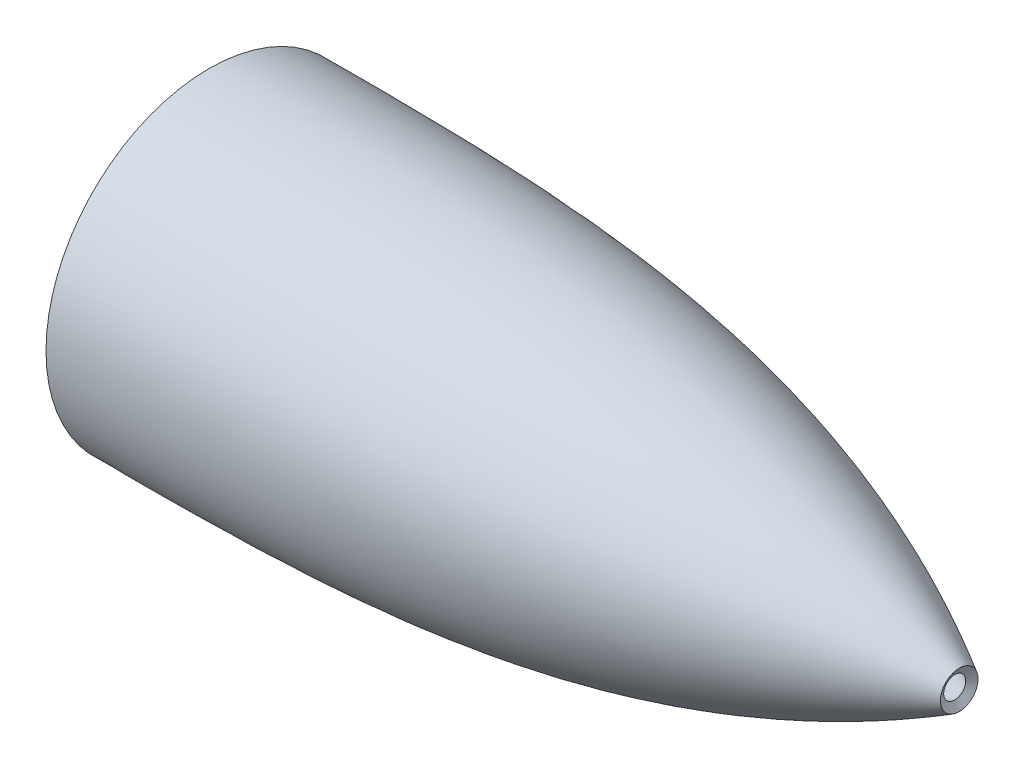
ISO-10303-21;
HEADER;
FILE_DESCRIPTION(('STEP AP214'),'2;1');
FILE_NAME('part.step','',(''),(''),'','','');
FILE_SCHEMA(('AUTOMOTIVE_DESIGN { 1 0 10303 214 1 1 1 1 }'));
ENDSEC;
DATA;
#1=APPLICATION_CONTEXT('core data for automotive mechanical design processes');
#2=APPLICATION_PROTOCOL_DEFINITION('international standard','automotive_design',2000,#1);
#3=PRODUCT_CONTEXT('',#1,'mechanical');
#4=PRODUCT('Part','Part','',(#3));
#5=PRODUCT_RELATED_PRODUCT_CATEGORY('part','',(#4));
#6=PRODUCT_DEFINITION_FORMATION('','',#4);
#7=PRODUCT_DEFINITION_CONTEXT('part definition',#1,'design');
#8=PRODUCT_DEFINITION('design','',#6,#7);
#9=PRODUCT_DEFINITION_SHAPE('','',#8);
#10=(LENGTH_UNIT() NAMED_UNIT(*) SI_UNIT(.MILLI.,.METRE.));
#11=(NAMED_UNIT(*) PLANE_ANGLE_UNIT() SI_UNIT($,.RADIAN.));
#12=(NAMED_UNIT(*) SI_UNIT($,.STERADIAN.) SOLID_ANGLE_UNIT());
#13=UNCERTAINTY_MEASURE_WITH_UNIT(LENGTH_MEASURE(1.E-05),#10,'distance_accuracy_value','');
#14=(GEOMETRIC_REPRESENTATION_CONTEXT(3) GLOBAL_UNCERTAINTY_ASSIGNED_CONTEXT((#13)) GLOBAL_UNIT_ASSIGNED_CONTEXT((#10,
#11,#12)) REPRESENTATION_CONTEXT('',''));
#15=CARTESIAN_POINT('',(0.,0.,0.));
#16=DIRECTION('',(0.,0.,1.));
#17=DIRECTION('',(1.,0.,0.));
#18=AXIS2_PLACEMENT_3D('',#15,#16,#17);
#19=CARTESIAN_POINT('',(-1998.59980802861,10.4300161785152,0.));
#20=CARTESIAN_POINT('',(-2014.14259062486,19.4045646924462,0.));
#21=CARTESIAN_POINT('',(-2030.01224919325,27.558302677373,0.));
#22=CARTESIAN_POINT('',(-2062.40654859525,42.2210681594105,0.));
#23=CARTESIAN_POINT('',(-2078.93137499077,48.7296296963989,0.));
#24=CARTESIAN_POINT('',(-2104.19714689456,57.2908408254729,0.));
#25=CARTESIAN_POINT('',(-2112.69866377501,59.9447139867935,0.));
#26=CARTESIAN_POINT('',(-2125.56706385674,63.6339255855182,0.));
#27=CARTESIAN_POINT('',(-2132.03027736365,65.4056763559408,0.));
#28=CARTESIAN_POINT('',(-2138.53622029027,67.0701302902628,0.));
#29=CARTESIAN_POINT('',(-2142.88291162473,68.156172047267,0.));
#30=CARTESIAN_POINT('',(-2145.06182038872,68.6875957351419,0.));
#31=CARTESIAN_POINT('',(-2164.68617644722,73.3589276736872,0.));
#32=CARTESIAN_POINT('',(-2182.25360633561,76.7232642966897,0.));
#33=CARTESIAN_POINT('',(-2217.59489504651,82.1354899233301,0.));
#34=CARTESIAN_POINT('',(-2235.36873230754,84.1835164298222,0.));
#35=CARTESIAN_POINT('',(-2262.14953112241,86.4900132132574,0.));
#36=CARTESIAN_POINT('',(-2271.08385534817,87.1304462783594,0.));
#37=CARTESIAN_POINT('',(-2288.95484670745,88.1960069303877,0.));
#38=CARTESIAN_POINT('',(-2297.8933291923,88.6212942490631,0.));
#39=CARTESIAN_POINT('',(-2342.59769770862,90.3174395440905,0.));
#40=CARTESIAN_POINT('',(-2378.39952151114,90.2949225553577,0.));
#41=CARTESIAN_POINT('',(-2414.20089839684,90.2884897864431,0.));
#42=B_SPLINE_CURVE_WITH_KNOTS('',3,(#19,#20,#21,#22,#23,#24,#25,#26,#27,#28,#29,#30,#31,#32,#33,
#34,#35,#36,#37,#38,#39,#40,#41),.UNSPECIFIED.,.F.,.F.,(4,2,2,2,1,2,2,2,2,2,2,4),(0.,
0.124999999999993,0.249999999999986,0.312499999999981,0.343749999999978,0.359374999999977,
0.374999999999976,0.49999999999998,0.624999999999985,0.687499999999988,0.74999999999999,1.),.UNSPECIFIED.);
#43=CARTESIAN_POINT('',(-2491.0020049198,0.,0.));
#44=DIRECTION('',(-1.,0.,0.));
#45=AXIS1_PLACEMENT('',#43,#44);
#46=SURFACE_OF_REVOLUTION('',#42,#45);
#47=CARTESIAN_POINT('',(-2414.20089839684,0.,0.));
#48=DIRECTION('',(-1.,0.,0.));
#49=DIRECTION('',(0.,0.,1.));
#50=AXIS2_PLACEMENT_3D('',#47,#48,#49);
#51=CIRCLE('',#50,90.2884897864431);
#52=CARTESIAN_POINT('',(-2414.20089839684,0.,90.2884897864431));
#53=VERTEX_POINT('',#52);
#54=EDGE_CURVE('E51',#53,#53,#51,.T.);
#55=ORIENTED_EDGE('',*,*,#54,.F.);
#56=EDGE_LOOP('',(#55));
#57=FACE_BOUND('',#56,.T.);
#58=CARTESIAN_POINT('',(-1998.59980802861,0.,0.));
#59=DIRECTION('',(-1.,0.,0.));
#60=DIRECTION('',(0.,0.,1.));
#61=AXIS2_PLACEMENT_3D('',#58,#59,#60);
#62=CIRCLE('',#61,10.4300161785152);
#63=CARTESIAN_POINT('',(-1998.59980802861,0.,10.4300161785152));
#64=VERTEX_POINT('',#63);
#65=EDGE_CURVE('E10',#64,#64,#62,.T.);
#66=ORIENTED_EDGE('',*,*,#65,.T.);
#67=EDGE_LOOP('',(#66));
#68=FACE_BOUND('',#67,.T.);
#69=ADVANCED_FACE('F36',(#57,#68),#46,.T.);
#70=CARTESIAN_POINT('',(-2001.1,0.,0.));
#71=DIRECTION('',(1.,0.,0.));
#72=DIRECTION('',(0.,0.,-1.));
#73=AXIS2_PLACEMENT_3D('',#70,#71,#72);
#74=CONICAL_SURFACE('',#73,6.10000000000022,1.04715321673594);
#75=ORIENTED_EDGE('',*,*,#65,.F.);
#76=EDGE_LOOP('',(#75));
#77=FACE_BOUND('',#76,.T.);
#78=CARTESIAN_POINT('',(-2001.1,0.,0.));
#79=DIRECTION('',(-1.,0.,0.));
#80=DIRECTION('',(0.,0.,1.));
#81=AXIS2_PLACEMENT_3D('',#78,#79,#80);
#82=CIRCLE('',#81,6.10000000000022);
#83=CARTESIAN_POINT('',(-2001.1,0.,6.10000000000022));
#84=VERTEX_POINT('',#83);
#85=EDGE_CURVE('E43',#84,#84,#82,.T.);
#86=ORIENTED_EDGE('',*,*,#85,.T.);
#87=EDGE_LOOP('',(#86));
#88=FACE_BOUND('',#87,.T.);
#89=ADVANCED_FACE('F70',(#77,#88),#74,.F.);
#90=CARTESIAN_POINT('',(-2414.2,85.2884898671548,0.));
#91=CARTESIAN_POINT('',(-2276.5,85.3132317166755,0.));
#92=CARTESIAN_POINT('',(-2138.8,85.6092720827538,0.));
#93=CARTESIAN_POINT('',(-2001.1,6.10000000000022,0.));
#94=B_SPLINE_CURVE_WITH_KNOTS('',3,(#90,#91,#92,#93),.UNSPECIFIED.,.F.,.F.,(4,4),
(0.0735402098982886,0.915776382718057),.UNSPECIFIED.);
#95=CARTESIAN_POINT('',(-2491.0020049198,0.,0.));
#96=DIRECTION('',(-1.,0.,0.));
#97=AXIS1_PLACEMENT('',#95,#96);
#98=SURFACE_OF_REVOLUTION('',#94,#97);
#99=ORIENTED_EDGE('',*,*,#85,.F.);
#100=EDGE_LOOP('',(#99));
#101=FACE_BOUND('',#100,.T.);
#102=CARTESIAN_POINT('',(-2414.2,0.,0.));
#103=DIRECTION('',(-1.,0.,0.));
#104=DIRECTION('',(0.,0.,1.));
#105=AXIS2_PLACEMENT_3D('',#102,#103,#104);
#106=CIRCLE('',#105,85.2884898671548);
#107=CARTESIAN_POINT('',(-2414.2,0.,85.2884898671548));
#108=VERTEX_POINT('',#107);
#109=EDGE_CURVE('E47',#108,#108,#106,.T.);
#110=ORIENTED_EDGE('',*,*,#109,.T.);
#111=EDGE_LOOP('',(#110));
#112=FACE_BOUND('',#111,.T.);
#113=ADVANCED_FACE('F66',(#101,#112),#98,.T.);
#114=CARTESIAN_POINT('',(-2414.20089839684,0.,0.));
#115=DIRECTION('',(-1.,0.,0.));
#116=DIRECTION('',(0.,0.,1.));
#117=AXIS2_PLACEMENT_3D('',#114,#115,#116);
#118=CONICAL_SURFACE('',#117,90.2884897864431,1.57061664742486);
#119=ORIENTED_EDGE('',*,*,#109,.F.);
#120=EDGE_LOOP('',(#119));
#121=FACE_BOUND('',#120,.T.);
#122=ORIENTED_EDGE('',*,*,#54,.T.);
#123=EDGE_LOOP('',(#122));
#124=FACE_BOUND('',#123,.T.);
#125=ADVANCED_FACE('F69',(#121,#124),#118,.F.);
#126=CLOSED_SHELL('',(#69,#89,#113,#125));
#127=MANIFOLD_SOLID_BREP('B2',#126);
#128=ADVANCED_BREP_SHAPE_REPRESENTATION('',(#18,#127),#14);
#129=SHAPE_DEFINITION_REPRESENTATION(#9,#128);
ENDSEC;
END-ISO-10303-21;
